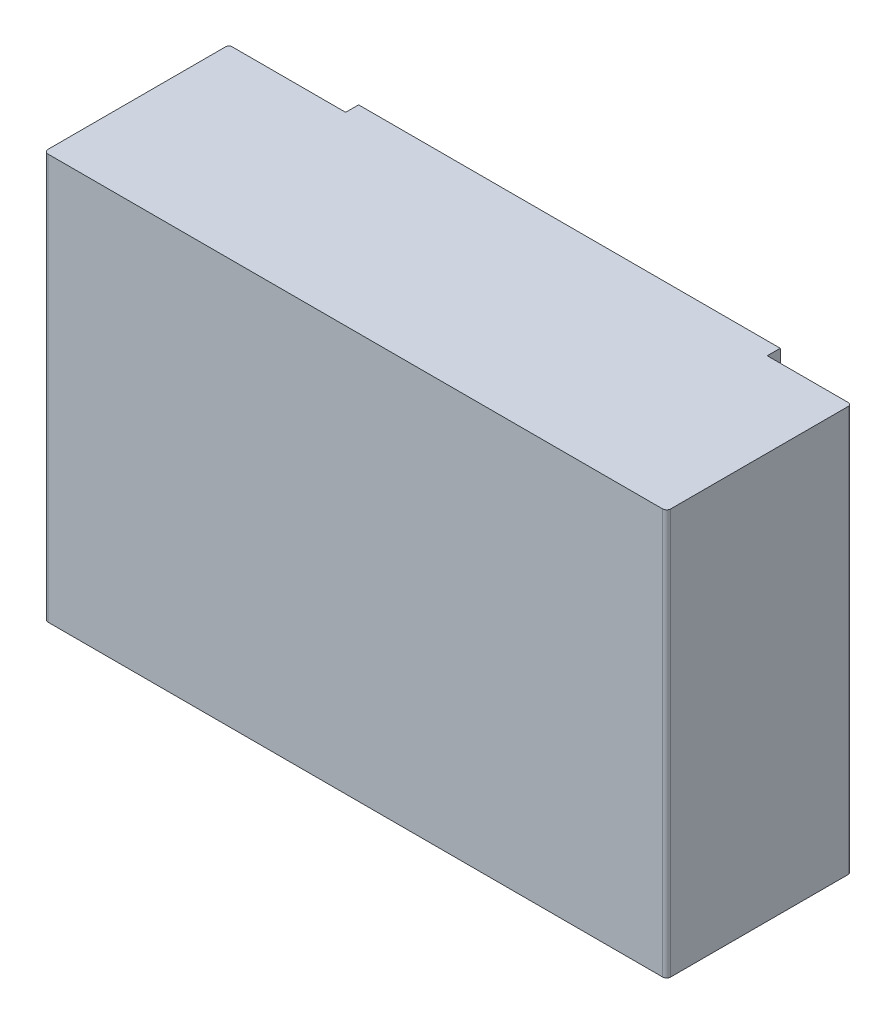
ISO-10303-21;
HEADER;
FILE_DESCRIPTION(('STEP AP214'),'2;1');
FILE_NAME('part.step','',(''),(''),'','','');
FILE_SCHEMA(('AUTOMOTIVE_DESIGN { 1 0 10303 214 1 1 1 1 }'));
ENDSEC;
DATA;
#1=APPLICATION_CONTEXT('core data for automotive mechanical design processes');
#2=APPLICATION_PROTOCOL_DEFINITION('international standard','automotive_design',2000,#1);
#3=PRODUCT_CONTEXT('',#1,'mechanical');
#4=PRODUCT('Part','Part','',(#3));
#5=PRODUCT_RELATED_PRODUCT_CATEGORY('part','',(#4));
#6=PRODUCT_DEFINITION_FORMATION('','',#4);
#7=PRODUCT_DEFINITION_CONTEXT('part definition',#1,'design');
#8=PRODUCT_DEFINITION('design','',#6,#7);
#9=PRODUCT_DEFINITION_SHAPE('','',#8);
#10=(LENGTH_UNIT() NAMED_UNIT(*) SI_UNIT(.MILLI.,.METRE.));
#11=(NAMED_UNIT(*) PLANE_ANGLE_UNIT() SI_UNIT($,.RADIAN.));
#12=(NAMED_UNIT(*) SI_UNIT($,.STERADIAN.) SOLID_ANGLE_UNIT());
#13=UNCERTAINTY_MEASURE_WITH_UNIT(LENGTH_MEASURE(1.E-05),#10,'distance_accuracy_value','');
#14=(GEOMETRIC_REPRESENTATION_CONTEXT(3) GLOBAL_UNCERTAINTY_ASSIGNED_CONTEXT((#13)) GLOBAL_UNIT_ASSIGNED_CONTEXT((#10,
#11,#12)) REPRESENTATION_CONTEXT('',''));
#15=CARTESIAN_POINT('',(0.,0.,0.));
#16=DIRECTION('',(0.,0.,1.));
#17=DIRECTION('',(1.,0.,0.));
#18=AXIS2_PLACEMENT_3D('',#15,#16,#17);
#19=CARTESIAN_POINT('',(0.,0.,0.));
#20=DIRECTION('',(0.,0.,1.));
#21=DIRECTION('',(1.,0.,0.));
#22=AXIS2_PLACEMENT_3D('',#19,#20,#21);
#23=PLANE('',#22);
#24=DIRECTION('',(0.,-1.,0.));
#25=VECTOR('',#24,1.);
#26=CARTESIAN_POINT('',(0.7,0.3125,0.));
#27=LINE('',#26,#25);
#28=CARTESIAN_POINT('',(0.7,0.625,0.));
#29=VERTEX_POINT('',#28);
#30=CARTESIAN_POINT('',(0.7,-0.625,0.));
#31=VERTEX_POINT('',#30);
#32=EDGE_CURVE('E190',#29,#31,#27,.T.);
#33=ORIENTED_EDGE('',*,*,#32,.T.);
#34=DIRECTION('',(1.,0.,0.));
#35=VECTOR('',#34,1.);
#36=CARTESIAN_POINT('',(-1.,-0.625,0.));
#37=LINE('',#36,#35);
#38=CARTESIAN_POINT('',(-0.6,-0.625,0.));
#39=VERTEX_POINT('',#38);
#40=EDGE_CURVE('E171',#39,#31,#37,.T.);
#41=ORIENTED_EDGE('',*,*,#40,.F.);
#42=DIRECTION('',(0.,1.,0.));
#43=VECTOR('',#42,1.);
#44=CARTESIAN_POINT('',(-0.6,0.3125,0.));
#45=LINE('',#44,#43);
#46=CARTESIAN_POINT('',(-0.6,0.625,0.));
#47=VERTEX_POINT('',#46);
#48=EDGE_CURVE('E11',#39,#47,#45,.T.);
#49=ORIENTED_EDGE('',*,*,#48,.T.);
#50=DIRECTION('',(-1.,0.,0.));
#51=VECTOR('',#50,1.);
#52=CARTESIAN_POINT('',(1.,0.625,0.));
#53=LINE('',#52,#51);
#54=EDGE_CURVE('E156',#29,#47,#53,.T.);
#55=ORIENTED_EDGE('',*,*,#54,.F.);
#56=EDGE_LOOP('',(#33,#41,#49,#55));
#57=FACE_BOUND('',#56,.T.);
#58=ADVANCED_FACE('F16',(#57),#23,.F.);
#59=CARTESIAN_POINT('',(-0.6,0.625,0.));
#60=DIRECTION('',(1.,0.,0.));
#61=DIRECTION('',(0.,1.,0.));
#62=AXIS2_PLACEMENT_3D('',#59,#60,#61);
#63=PLANE('',#62);
#64=DIRECTION('',(0.,0.,-1.));
#65=VECTOR('',#64,1.);
#66=CARTESIAN_POINT('',(-0.6,-0.625,0.));
#67=LINE('',#66,#65);
#68=CARTESIAN_POINT('',(-0.6,-0.625,0.04));
#69=VERTEX_POINT('',#68);
#70=EDGE_CURVE('E179',#69,#39,#67,.T.);
#71=ORIENTED_EDGE('',*,*,#70,.F.);
#72=DIRECTION('',(0.,-1.,0.));
#73=VECTOR('',#72,1.);
#74=CARTESIAN_POINT('',(-0.6,0.625,0.04));
#75=LINE('',#74,#73);
#76=CARTESIAN_POINT('',(-0.6,0.625,0.04));
#77=VERTEX_POINT('',#76);
#78=EDGE_CURVE('E27',#77,#69,#75,.T.);
#79=ORIENTED_EDGE('',*,*,#78,.F.);
#80=DIRECTION('',(0.,0.,1.));
#81=VECTOR('',#80,1.);
#82=CARTESIAN_POINT('',(-0.6,0.625,0.));
#83=LINE('',#82,#81);
#84=EDGE_CURVE('E166',#47,#77,#83,.T.);
#85=ORIENTED_EDGE('',*,*,#84,.F.);
#86=ORIENTED_EDGE('',*,*,#48,.F.);
#87=EDGE_LOOP('',(#71,#79,#85,#86));
#88=FACE_BOUND('',#87,.T.);
#89=ADVANCED_FACE('F367',(#88),#63,.F.);
#90=CARTESIAN_POINT('',(-0.6,0.625,0.04));
#91=DIRECTION('',(0.,0.,1.));
#92=DIRECTION('',(1.,0.,0.));
#93=AXIS2_PLACEMENT_3D('',#90,#91,#92);
#94=PLANE('',#93);
#95=DIRECTION('',(1.,0.,0.));
#96=VECTOR('',#95,1.);
#97=CARTESIAN_POINT('',(-0.8,-0.625,0.04));
#98=LINE('',#97,#96);
#99=CARTESIAN_POINT('',(-0.95,-0.625,0.04));
#100=VERTEX_POINT('',#99);
#101=EDGE_CURVE('E186',#100,#69,#98,.T.);
#102=ORIENTED_EDGE('',*,*,#101,.F.);
#103=DIRECTION('',(0.,-1.,0.));
#104=VECTOR('',#103,1.);
#105=CARTESIAN_POINT('',(-0.95,0.625,0.04));
#106=LINE('',#105,#104);
#107=CARTESIAN_POINT('',(-0.95,0.625,0.04));
#108=VERTEX_POINT('',#107);
#109=EDGE_CURVE('E202',#108,#100,#106,.T.);
#110=ORIENTED_EDGE('',*,*,#109,.F.);
#111=DIRECTION('',(-1.,0.,0.));
#112=VECTOR('',#111,1.);
#113=CARTESIAN_POINT('',(0.2,0.625,0.04));
#114=LINE('',#113,#112);
#115=EDGE_CURVE('E162',#77,#108,#114,.T.);
#116=ORIENTED_EDGE('',*,*,#115,.F.);
#117=ORIENTED_EDGE('',*,*,#78,.T.);
#118=EDGE_LOOP('',(#102,#110,#116,#117));
#119=FACE_BOUND('',#118,.T.);
#120=ADVANCED_FACE('F18',(#119),#94,.F.);
#121=CARTESIAN_POINT('',(-0.95,0.625,0.05));
#122=DIRECTION('',(0.,-1.,0.));
#123=DIRECTION('',(0.,0.,1.));
#124=AXIS2_PLACEMENT_3D('',#121,#122,#123);
#125=CYLINDRICAL_SURFACE('',#124,0.01);
#126=CARTESIAN_POINT('',(-0.95,-0.625,0.05));
#127=DIRECTION('',(0.,-1.,0.));
#128=DIRECTION('',(0.,0.,1.));
#129=AXIS2_PLACEMENT_3D('',#126,#127,#128);
#130=CIRCLE('',#129,0.01);
#131=CARTESIAN_POINT('',(-0.96,-0.625,0.05000000004657));
#132=VERTEX_POINT('',#131);
#133=EDGE_CURVE('E218',#132,#100,#130,.T.);
#134=ORIENTED_EDGE('',*,*,#133,.F.);
#135=DIRECTION('',(0.,-1.,0.));
#136=VECTOR('',#135,1.);
#137=CARTESIAN_POINT('',(-0.96,0.625,0.05000000004657));
#138=LINE('',#137,#136);
#139=CARTESIAN_POINT('',(-0.96,0.625,0.05000000004657));
#140=VERTEX_POINT('',#139);
#141=EDGE_CURVE('E210',#140,#132,#138,.T.);
#142=ORIENTED_EDGE('',*,*,#141,.F.);
#143=CARTESIAN_POINT('',(-0.95,0.625,0.05));
#144=DIRECTION('',(0.,1.,0.));
#145=DIRECTION('',(0.,0.,1.));
#146=AXIS2_PLACEMENT_3D('',#143,#144,#145);
#147=CIRCLE('',#146,0.01);
#148=EDGE_CURVE('E165',#108,#140,#147,.T.);
#149=ORIENTED_EDGE('',*,*,#148,.F.);
#150=ORIENTED_EDGE('',*,*,#109,.T.);
#151=EDGE_LOOP('',(#134,#142,#149,#150));
#152=FACE_BOUND('',#151,.T.);
#153=ADVANCED_FACE('F378',(#152),#125,.T.);
#154=CARTESIAN_POINT('',(-0.96,0.625,0.05000000004657));
#155=DIRECTION('',(1.,0.,0.));
#156=DIRECTION('',(0.,0.,-1.));
#157=AXIS2_PLACEMENT_3D('',#154,#155,#156);
#158=PLANE('',#157);
#159=DIRECTION('',(0.,-1.,0.));
#160=VECTOR('',#159,1.);
#161=CARTESIAN_POINT('',(-0.96,0.,0.597752186769));
#162=LINE('',#161,#160);
#163=CARTESIAN_POINT('',(-0.96,0.625,0.597752186769));
#164=VERTEX_POINT('',#163);
#165=CARTESIAN_POINT('',(-0.96,-0.625,0.597752186769));
#166=VERTEX_POINT('',#165);
#167=EDGE_CURVE('E195',#164,#166,#162,.T.);
#168=ORIENTED_EDGE('',*,*,#167,.F.);
#169=DIRECTION('',(0.,0.,1.));
#170=VECTOR('',#169,1.);
#171=CARTESIAN_POINT('',(-0.96,0.625,0.02500000002328));
#172=LINE('',#171,#170);
#173=EDGE_CURVE('E225',#140,#164,#172,.T.);
#174=ORIENTED_EDGE('',*,*,#173,.F.);
#175=ORIENTED_EDGE('',*,*,#141,.T.);
#176=DIRECTION('',(0.,0.,-1.));
#177=VECTOR('',#176,1.);
#178=CARTESIAN_POINT('',(-0.96,-0.625,0.02500000002328));
#179=LINE('',#178,#177);
#180=EDGE_CURVE('E258',#166,#132,#179,.T.);
#181=ORIENTED_EDGE('',*,*,#180,.F.);
#182=EDGE_LOOP('',(#168,#174,#175,#181));
#183=FACE_BOUND('',#182,.T.);
#184=ADVANCED_FACE('F383',(#183),#158,.F.);
#185=CARTESIAN_POINT('',(0.95,0.625,0.05));
#186=DIRECTION('',(0.,-1.,0.));
#187=DIRECTION('',(-1.,0.,-4.656611901632E-09));
#188=AXIS2_PLACEMENT_3D('',#185,#186,#187);
#189=CYLINDRICAL_SURFACE('',#188,0.01);
#190=CARTESIAN_POINT('',(0.95,-0.625,0.05));
#191=DIRECTION('',(0.,-1.,0.));
#192=DIRECTION('',(-1.,0.,-4.656611901632E-09));
#193=AXIS2_PLACEMENT_3D('',#190,#191,#192);
#194=CIRCLE('',#193,0.01);
#195=CARTESIAN_POINT('',(0.950000000023,-0.625,0.04));
#196=VERTEX_POINT('',#195);
#197=CARTESIAN_POINT('',(0.96,-0.625,0.05000000004657));
#198=VERTEX_POINT('',#197);
#199=EDGE_CURVE('E123',#196,#198,#194,.T.);
#200=ORIENTED_EDGE('',*,*,#199,.F.);
#201=DIRECTION('',(0.,-1.,0.));
#202=VECTOR('',#201,1.);
#203=CARTESIAN_POINT('',(0.950000000023,0.625,0.04));
#204=LINE('',#203,#202);
#205=CARTESIAN_POINT('',(0.950000000023,0.625,0.04));
#206=VERTEX_POINT('',#205);
#207=EDGE_CURVE('E41',#206,#196,#204,.T.);
#208=ORIENTED_EDGE('',*,*,#207,.F.);
#209=CARTESIAN_POINT('',(0.95,0.625,0.05));
#210=DIRECTION('',(0.,1.,0.));
#211=DIRECTION('',(-1.,0.,-4.656611901632E-09));
#212=AXIS2_PLACEMENT_3D('',#209,#210,#211);
#213=CIRCLE('',#212,0.01);
#214=CARTESIAN_POINT('',(0.96,0.625,0.05000000004657));
#215=VERTEX_POINT('',#214);
#216=EDGE_CURVE('E207',#215,#206,#213,.T.);
#217=ORIENTED_EDGE('',*,*,#216,.F.);
#218=DIRECTION('',(0.,-1.,0.));
#219=VECTOR('',#218,1.);
#220=CARTESIAN_POINT('',(0.96,0.625,0.05000000004657));
#221=LINE('',#220,#219);
#222=EDGE_CURVE('E128',#215,#198,#221,.T.);
#223=ORIENTED_EDGE('',*,*,#222,.T.);
#224=EDGE_LOOP('',(#200,#208,#217,#223));
#225=FACE_BOUND('',#224,.T.);
#226=ADVANCED_FACE('F395',(#225),#189,.T.);
#227=CARTESIAN_POINT('',(0.950000000023,0.625,0.04));
#228=DIRECTION('',(0.,0.,1.));
#229=DIRECTION('',(1.,0.,0.));
#230=AXIS2_PLACEMENT_3D('',#227,#228,#229);
#231=PLANE('',#230);
#232=DIRECTION('',(1.,0.,0.));
#233=VECTOR('',#232,1.);
#234=CARTESIAN_POINT('',(-0.02499999998836,-0.625,0.04));
#235=LINE('',#234,#233);
#236=CARTESIAN_POINT('',(0.7,-0.625,0.04));
#237=VERTEX_POINT('',#236);
#238=EDGE_CURVE('E170',#237,#196,#235,.T.);
#239=ORIENTED_EDGE('',*,*,#238,.F.);
#240=DIRECTION('',(0.,-1.,0.));
#241=VECTOR('',#240,1.);
#242=CARTESIAN_POINT('',(0.7,0.625,0.04));
#243=LINE('',#242,#241);
#244=CARTESIAN_POINT('',(0.7,0.625,0.04));
#245=VERTEX_POINT('',#244);
#246=EDGE_CURVE('E233',#245,#237,#243,.T.);
#247=ORIENTED_EDGE('',*,*,#246,.F.);
#248=DIRECTION('',(-1.,0.,0.));
#249=VECTOR('',#248,1.);
#250=CARTESIAN_POINT('',(0.975000000012,0.625,0.04));
#251=LINE('',#250,#249);
#252=EDGE_CURVE('E161',#206,#245,#251,.T.);
#253=ORIENTED_EDGE('',*,*,#252,.F.);
#254=ORIENTED_EDGE('',*,*,#207,.T.);
#255=EDGE_LOOP('',(#239,#247,#253,#254));
#256=FACE_BOUND('',#255,.T.);
#257=ADVANCED_FACE('F389',(#256),#231,.F.);
#258=CARTESIAN_POINT('',(0.7,0.625,0.04));
#259=DIRECTION('',(-1.,0.,0.));
#260=DIRECTION('',(0.,0.,1.));
#261=AXIS2_PLACEMENT_3D('',#258,#259,#260);
#262=PLANE('',#261);
#263=DIRECTION('',(0.,0.,1.));
#264=VECTOR('',#263,1.);
#265=CARTESIAN_POINT('',(0.7,-0.625,0.02));
#266=LINE('',#265,#264);
#267=EDGE_CURVE('E167',#31,#237,#266,.T.);
#268=ORIENTED_EDGE('',*,*,#267,.F.);
#269=ORIENTED_EDGE('',*,*,#32,.F.);
#270=DIRECTION('',(0.,0.,-1.));
#271=VECTOR('',#270,1.);
#272=CARTESIAN_POINT('',(0.7,0.625,0.02));
#273=LINE('',#272,#271);
#274=EDGE_CURVE('E157',#245,#29,#273,.T.);
#275=ORIENTED_EDGE('',*,*,#274,.F.);
#276=ORIENTED_EDGE('',*,*,#246,.T.);
#277=EDGE_LOOP('',(#268,#269,#275,#276));
#278=FACE_BOUND('',#277,.T.);
#279=ADVANCED_FACE('F394',(#278),#262,.F.);
#280=CARTESIAN_POINT('',(-1.,-0.625,0.));
#281=DIRECTION('',(0.,-1.,0.));
#282=DIRECTION('',(0.,0.,-1.));
#283=AXIS2_PLACEMENT_3D('',#280,#281,#282);
#284=PLANE('',#283);
#285=CARTESIAN_POINT('',(0.9475,-0.625,0.597752186769));
#286=DIRECTION('',(0.,1.,0.));
#287=DIRECTION('',(0.707106781186548,0.,0.707106781186548));
#288=AXIS2_PLACEMENT_3D('',#285,#286,#287);
#289=CIRCLE('',#288,0.0125);
#290=CARTESIAN_POINT('',(0.9475,-0.625,0.610252186769));
#291=VERTEX_POINT('',#290);
#292=CARTESIAN_POINT('',(0.96,-0.625,0.597752186769));
#293=VERTEX_POINT('',#292);
#294=EDGE_CURVE('E120',#291,#293,#289,.T.);
#295=ORIENTED_EDGE('',*,*,#294,.F.);
#296=DIRECTION('',(-1.,0.,0.));
#297=VECTOR('',#296,1.);
#298=CARTESIAN_POINT('',(0.96,-0.625,0.610252186769));
#299=LINE('',#298,#297);
#300=CARTESIAN_POINT('',(-0.9475,-0.625,0.610252186769));
#301=VERTEX_POINT('',#300);
#302=EDGE_CURVE('E208',#291,#301,#299,.T.);
#303=ORIENTED_EDGE('',*,*,#302,.T.);
#304=CARTESIAN_POINT('',(-0.9475,-0.625,0.597752186769));
#305=DIRECTION('',(0.,1.,0.));
#306=DIRECTION('',(-0.707106781186548,0.,0.707106781186548));
#307=AXIS2_PLACEMENT_3D('',#304,#305,#306);
#308=CIRCLE('',#307,0.0125);
#309=EDGE_CURVE('E129',#166,#301,#308,.T.);
#310=ORIENTED_EDGE('',*,*,#309,.F.);
#311=ORIENTED_EDGE('',*,*,#180,.T.);
#312=ORIENTED_EDGE('',*,*,#133,.T.);
#313=ORIENTED_EDGE('',*,*,#101,.T.);
#314=ORIENTED_EDGE('',*,*,#70,.T.);
#315=ORIENTED_EDGE('',*,*,#40,.T.);
#316=ORIENTED_EDGE('',*,*,#267,.T.);
#317=ORIENTED_EDGE('',*,*,#238,.T.);
#318=ORIENTED_EDGE('',*,*,#199,.T.);
#319=DIRECTION('',(0.,0.,1.));
#320=VECTOR('',#319,1.);
#321=CARTESIAN_POINT('',(0.96,-0.625,0.56));
#322=LINE('',#321,#320);
#323=EDGE_CURVE('E115',#198,#293,#322,.T.);
#324=ORIENTED_EDGE('',*,*,#323,.T.);
#325=EDGE_LOOP('',(#295,#303,#310,#311,#312,#313,#314,#315,#316,#317,#318,#324));
#326=FACE_BOUND('',#325,.T.);
#327=ADVANCED_FACE('F117',(#326),#284,.T.);
#328=CARTESIAN_POINT('',(0.96,0.625,0.6));
#329=DIRECTION('',(-1.,0.,0.));
#330=DIRECTION('',(0.,0.,1.));
#331=AXIS2_PLACEMENT_3D('',#328,#329,#330);
#332=PLANE('',#331);
#333=DIRECTION('',(0.,1.,0.));
#334=VECTOR('',#333,1.);
#335=CARTESIAN_POINT('',(0.96,0.,0.597752186769));
#336=LINE('',#335,#334);
#337=CARTESIAN_POINT('',(0.96,0.625,0.597752186769));
#338=VERTEX_POINT('',#337);
#339=EDGE_CURVE('E133',#293,#338,#336,.T.);
#340=ORIENTED_EDGE('',*,*,#339,.F.);
#341=ORIENTED_EDGE('',*,*,#323,.F.);
#342=ORIENTED_EDGE('',*,*,#222,.F.);
#343=DIRECTION('',(0.,0.,-1.));
#344=VECTOR('',#343,1.);
#345=CARTESIAN_POINT('',(0.96,0.625,0.3));
#346=LINE('',#345,#344);
#347=EDGE_CURVE('E137',#338,#215,#346,.T.);
#348=ORIENTED_EDGE('',*,*,#347,.F.);
#349=EDGE_LOOP('',(#340,#341,#342,#348));
#350=FACE_BOUND('',#349,.T.);
#351=ADVANCED_FACE('F134',(#350),#332,.F.);
#352=CARTESIAN_POINT('',(-0.9475,0.,0.597752186769));
#353=DIRECTION('',(0.,1.,0.));
#354=DIRECTION('',(-0.707106781186548,0.,0.707106781186548));
#355=AXIS2_PLACEMENT_3D('',#352,#353,#354);
#356=CYLINDRICAL_SURFACE('',#355,0.0125);
#357=CARTESIAN_POINT('',(-0.9475,0.625,0.597752186769));
#358=DIRECTION('',(0.,-1.,0.));
#359=DIRECTION('',(-0.707106781186548,0.,0.707106781186548));
#360=AXIS2_PLACEMENT_3D('',#357,#358,#359);
#361=CIRCLE('',#360,0.0125);
#362=CARTESIAN_POINT('',(-0.9475,0.625,0.610252186769));
#363=VERTEX_POINT('',#362);
#364=EDGE_CURVE('E199',#363,#164,#361,.T.);
#365=ORIENTED_EDGE('',*,*,#364,.T.);
#366=ORIENTED_EDGE('',*,*,#167,.T.);
#367=ORIENTED_EDGE('',*,*,#309,.T.);
#368=DIRECTION('',(0.,1.,0.));
#369=VECTOR('',#368,1.);
#370=CARTESIAN_POINT('',(-0.9475,0.,0.610252186769));
#371=LINE('',#370,#369);
#372=EDGE_CURVE('E229',#301,#363,#371,.T.);
#373=ORIENTED_EDGE('',*,*,#372,.T.);
#374=EDGE_LOOP('',(#365,#366,#367,#373));
#375=FACE_BOUND('',#374,.T.);
#376=ADVANCED_FACE('F244',(#375),#356,.T.);
#377=CARTESIAN_POINT('',(1.,0.625,0.));
#378=DIRECTION('',(0.,1.,0.));
#379=DIRECTION('',(1.,0.,0.));
#380=AXIS2_PLACEMENT_3D('',#377,#378,#379);
#381=PLANE('',#380);
#382=CARTESIAN_POINT('',(0.9475,0.625,0.597752186769));
#383=DIRECTION('',(0.,-1.,0.));
#384=DIRECTION('',(0.707106781186548,0.,0.707106781186548));
#385=AXIS2_PLACEMENT_3D('',#382,#383,#384);
#386=CIRCLE('',#385,0.0125);
#387=CARTESIAN_POINT('',(0.9475,0.625,0.610252186769));
#388=VERTEX_POINT('',#387);
#389=EDGE_CURVE('E20',#338,#388,#386,.T.);
#390=ORIENTED_EDGE('',*,*,#389,.F.);
#391=ORIENTED_EDGE('',*,*,#347,.T.);
#392=ORIENTED_EDGE('',*,*,#216,.T.);
#393=ORIENTED_EDGE('',*,*,#252,.T.);
#394=ORIENTED_EDGE('',*,*,#274,.T.);
#395=ORIENTED_EDGE('',*,*,#54,.T.);
#396=ORIENTED_EDGE('',*,*,#84,.T.);
#397=ORIENTED_EDGE('',*,*,#115,.T.);
#398=ORIENTED_EDGE('',*,*,#148,.T.);
#399=ORIENTED_EDGE('',*,*,#173,.T.);
#400=ORIENTED_EDGE('',*,*,#364,.F.);
#401=DIRECTION('',(1.,0.,0.));
#402=VECTOR('',#401,1.);
#403=CARTESIAN_POINT('',(-0.48,0.625,0.610252186769));
#404=LINE('',#403,#402);
#405=EDGE_CURVE('E142',#363,#388,#404,.T.);
#406=ORIENTED_EDGE('',*,*,#405,.T.);
#407=EDGE_LOOP('',(#390,#391,#392,#393,#394,#395,#396,#397,#398,#399,#400,#406));
#408=FACE_BOUND('',#407,.T.);
#409=ADVANCED_FACE('F433',(#408),#381,.T.);
#410=CARTESIAN_POINT('',(-0.96,-0.625,0.610252186769));
#411=DIRECTION('',(0.,0.,1.));
#412=DIRECTION('',(1.,0.,0.));
#413=AXIS2_PLACEMENT_3D('',#410,#411,#412);
#414=PLANE('',#413);
#415=DIRECTION('',(0.,-1.,0.));
#416=VECTOR('',#415,1.);
#417=CARTESIAN_POINT('',(0.9475,0.,0.610252186769));
#418=LINE('',#417,#416);
#419=EDGE_CURVE('E146',#388,#291,#418,.T.);
#420=ORIENTED_EDGE('',*,*,#419,.F.);
#421=ORIENTED_EDGE('',*,*,#405,.F.);
#422=ORIENTED_EDGE('',*,*,#372,.F.);
#423=ORIENTED_EDGE('',*,*,#302,.F.);
#424=EDGE_LOOP('',(#420,#421,#422,#423));
#425=FACE_BOUND('',#424,.T.);
#426=ADVANCED_FACE('F252',(#425),#414,.T.);
#427=CARTESIAN_POINT('',(0.9475,0.,0.597752186769));
#428=DIRECTION('',(0.,1.,0.));
#429=DIRECTION('',(0.707106781186548,0.,0.707106781186548));
#430=AXIS2_PLACEMENT_3D('',#427,#428,#429);
#431=CYLINDRICAL_SURFACE('',#430,0.0125);
#432=ORIENTED_EDGE('',*,*,#389,.T.);
#433=ORIENTED_EDGE('',*,*,#419,.T.);
#434=ORIENTED_EDGE('',*,*,#294,.T.);
#435=ORIENTED_EDGE('',*,*,#339,.T.);
#436=EDGE_LOOP('',(#432,#433,#434,#435));
#437=FACE_BOUND('',#436,.T.);
#438=ADVANCED_FACE('F144',(#437),#431,.T.);
#439=CLOSED_SHELL('',(#58,#89,#120,#153,#184,#226,#257,#279,#327,#351,#376,#409,#426,#438));
#440=MANIFOLD_SOLID_BREP('B1',#439);
#441=ADVANCED_BREP_SHAPE_REPRESENTATION('',(#18,#440),#14);
#442=SHAPE_DEFINITION_REPRESENTATION(#9,#441);
ENDSEC;
END-ISO-10303-21;
